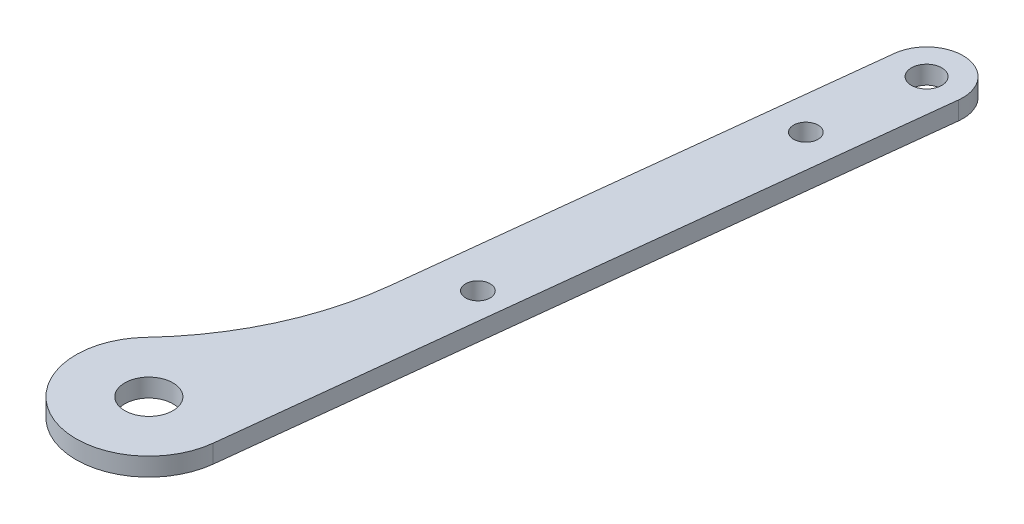
ISO-10303-21;
HEADER;
FILE_DESCRIPTION(('STEP AP214'),'2;1');
FILE_NAME('part.step','',(''),(''),'','','');
FILE_SCHEMA(('AUTOMOTIVE_DESIGN { 1 0 10303 214 1 1 1 1 }'));
ENDSEC;
DATA;
#1=APPLICATION_CONTEXT('core data for automotive mechanical design processes');
#2=APPLICATION_PROTOCOL_DEFINITION('international standard','automotive_design',2000,#1);
#3=PRODUCT_CONTEXT('',#1,'mechanical');
#4=PRODUCT('Part','Part','',(#3));
#5=PRODUCT_RELATED_PRODUCT_CATEGORY('part','',(#4));
#6=PRODUCT_DEFINITION_FORMATION('','',#4);
#7=PRODUCT_DEFINITION_CONTEXT('part definition',#1,'design');
#8=PRODUCT_DEFINITION('design','',#6,#7);
#9=PRODUCT_DEFINITION_SHAPE('','',#8);
#10=(LENGTH_UNIT() NAMED_UNIT(*) SI_UNIT(.MILLI.,.METRE.));
#11=(NAMED_UNIT(*) PLANE_ANGLE_UNIT() SI_UNIT($,.RADIAN.));
#12=(NAMED_UNIT(*) SI_UNIT($,.STERADIAN.) SOLID_ANGLE_UNIT());
#13=UNCERTAINTY_MEASURE_WITH_UNIT(LENGTH_MEASURE(1.E-05),#10,'distance_accuracy_value','');
#14=(GEOMETRIC_REPRESENTATION_CONTEXT(3) GLOBAL_UNCERTAINTY_ASSIGNED_CONTEXT((#13)) GLOBAL_UNIT_ASSIGNED_CONTEXT((#10,
#11,#12)) REPRESENTATION_CONTEXT('',''));
#15=CARTESIAN_POINT('',(0.,0.,0.));
#16=DIRECTION('',(0.,0.,1.));
#17=DIRECTION('',(1.,0.,0.));
#18=AXIS2_PLACEMENT_3D('',#15,#16,#17);
#19=CARTESIAN_POINT('',(6.56049999998811,-18.4375000000001,98.3869000000013));
#20=DIRECTION('',(0.,1.,0.));
#21=DIRECTION('',(0.,0.,1.));
#22=AXIS2_PLACEMENT_3D('',#19,#20,#21);
#23=PLANE('',#22);
#24=CARTESIAN_POINT('',(19.4709999999787,-18.4375000000001,37.1094));
#25=DIRECTION('',(0.,1.,0.));
#26=DIRECTION('',(0.,0.,1.));
#27=AXIS2_PLACEMENT_3D('',#24,#25,#26);
#28=CIRCLE('',#27,2.6543);
#29=CARTESIAN_POINT('',(19.4709999999787,-18.4375000000001,39.7637));
#30=VERTEX_POINT('',#29);
#31=EDGE_CURVE('E131',#30,#30,#28,.T.);
#32=ORIENTED_EDGE('',*,*,#31,.T.);
#33=EDGE_LOOP('',(#32));
#34=FACE_BOUND('',#33,.T.);
#35=CARTESIAN_POINT('',(0.,-18.4375000000001,153.3144));
#36=DIRECTION('',(0.,1.,0.));
#37=DIRECTION('',(0.,0.,1.));
#38=AXIS2_PLACEMENT_3D('',#35,#36,#37);
#39=CIRCLE('',#38,4.2037);
#40=CARTESIAN_POINT('',(0.,-18.4375000000001,157.5181));
#41=VERTEX_POINT('',#40);
#42=EDGE_CURVE('E134',#41,#41,#39,.T.);
#43=ORIENTED_EDGE('',*,*,#42,.T.);
#44=EDGE_LOOP('',(#43));
#45=FACE_BOUND('',#44,.T.);
#46=CARTESIAN_POINT('',(17.3400495907476,-18.4375000000001,56.0398397293865));
#47=DIRECTION('',(0.,-1.,0.));
#48=DIRECTION('',(0.,0.,-1.));
#49=AXIS2_PLACEMENT_3D('',#46,#47,#48);
#50=CIRCLE('',#49,2.1463);
#51=CARTESIAN_POINT('',(17.3400495907476,-18.4375000000001,53.8935397293865));
#52=VERTEX_POINT('',#51);
#53=EDGE_CURVE('E138',#52,#52,#50,.F.);
#54=ORIENTED_EDGE('',*,*,#53,.T.);
#55=EDGE_LOOP('',(#54));
#56=FACE_BOUND('',#55,.T.);
#57=CARTESIAN_POINT('',(12.7000000000016,-18.4375000000001,108.613413739759));
#58=DIRECTION('',(0.,-1.,0.));
#59=DIRECTION('',(0.,0.,-1.));
#60=AXIS2_PLACEMENT_3D('',#57,#58,#59);
#61=CIRCLE('',#60,2.1463);
#62=CARTESIAN_POINT('',(12.7000000000016,-18.4375000000001,106.467113739759));
#63=VERTEX_POINT('',#62);
#64=EDGE_CURVE('E142',#63,#63,#61,.F.);
#65=ORIENTED_EDGE('',*,*,#64,.T.);
#66=EDGE_LOOP('',(#65));
#67=FACE_BOUND('',#66,.T.);
#68=DIRECTION('',(0.111860914179471,0.,-0.99372387305475));
#69=VECTOR('',#68,1.);
#70=CARTESIAN_POINT('',(12.6202931877977,-18.4375000000001,154.735033610079));
#71=LINE('',#70,#69);
#72=CARTESIAN_POINT('',(12.6202931877977,-18.4375000000001,154.735033610079));
#73=VERTEX_POINT('',#72);
#74=CARTESIAN_POINT('',(25.7811465938763,-18.4375000000001,37.8197168050397));
#75=VERTEX_POINT('',#74);
#76=EDGE_CURVE('E69',#73,#75,#71,.T.);
#77=ORIENTED_EDGE('',*,*,#76,.F.);
#78=CARTESIAN_POINT('',(0.,-18.4375000000001,153.3144));
#79=DIRECTION('',(0.,1.,0.));
#80=DIRECTION('',(0.,0.,1.));
#81=AXIS2_PLACEMENT_3D('',#78,#79,#80);
#82=CIRCLE('',#81,12.7000000000024);
#83=CARTESIAN_POINT('',(-9.24385438419082,-18.4375000000001,144.605717199258));
#84=VERTEX_POINT('',#83);
#85=EDGE_CURVE('E147',#84,#73,#82,.T.);
#86=ORIENTED_EDGE('',*,*,#85,.F.);
#87=CARTESIAN_POINT('',(-46.219271920951,-18.4375000000001,109.770985996288));
#88=DIRECTION('',(0.,1.,0.));
#89=DIRECTION('',(0.,0.,1.));
#90=AXIS2_PLACEMENT_3D('',#87,#88,#89);
#91=CIRCLE('',#90,50.8000000000094);
#92=CARTESIAN_POINT('',(4.2619008302395,-18.4375000000001,115.453520436607));
#93=VERTEX_POINT('',#92);
#94=EDGE_CURVE('E87',#84,#93,#91,.T.);
#95=ORIENTED_EDGE('',*,*,#94,.T.);
#96=DIRECTION('',(-0.111860914179491,0.,0.993723873054748));
#97=VECTOR('',#96,1.);
#98=CARTESIAN_POINT('',(13.160853406081,-18.4375000000001,36.3990831949603));
#99=LINE('',#98,#97);
#100=CARTESIAN_POINT('',(13.1608534113733,-18.4375000000001,36.399083147946));
#101=VERTEX_POINT('',#100);
#102=EDGE_CURVE('E85',#101,#93,#99,.T.);
#103=ORIENTED_EDGE('',*,*,#102,.F.);
#104=CARTESIAN_POINT('',(19.4709999999787,-18.4375000000001,37.1094));
#105=DIRECTION('',(0.,1.,0.));
#106=DIRECTION('',(0.,0.,1.));
#107=AXIS2_PLACEMENT_3D('',#104,#105,#106);
#108=CIRCLE('',#107,6.35);
#109=EDGE_CURVE('E20',#75,#101,#108,.T.);
#110=ORIENTED_EDGE('',*,*,#109,.F.);
#111=EDGE_LOOP('',(#77,#86,#95,#103,#110));
#112=FACE_BOUND('',#111,.T.);
#113=ADVANCED_FACE('F17',(#34,#45,#56,#67,#112),#23,.F.);
#114=CARTESIAN_POINT('',(12.6202931877977,-18.4375000000001,154.735033610079));
#115=DIRECTION('',(0.99372387305475,0.,0.111860914179471));
#116=DIRECTION('',(0.111860914179471,0.,-0.99372387305475));
#117=AXIS2_PLACEMENT_3D('',#114,#115,#116);
#118=PLANE('',#117);
#119=ORIENTED_EDGE('',*,*,#76,.T.);
#120=DIRECTION('',(0.,1.,0.));
#121=VECTOR('',#120,1.);
#122=CARTESIAN_POINT('',(25.7811465938763,-18.4375000000001,37.8197168050397));
#123=LINE('',#122,#121);
#124=CARTESIAN_POINT('',(25.7811465938763,-15.2625,37.8197168050397));
#125=VERTEX_POINT('',#124);
#126=EDGE_CURVE('E81',#125,#75,#123,.F.);
#127=ORIENTED_EDGE('',*,*,#126,.F.);
#128=DIRECTION('',(0.11186091417947,0.,-0.99372387305475));
#129=VECTOR('',#128,1.);
#130=CARTESIAN_POINT('',(12.6202931877977,-15.2625,154.735033610079));
#131=LINE('',#130,#129);
#132=CARTESIAN_POINT('',(12.6202931877977,-15.2625,154.735033610079));
#133=VERTEX_POINT('',#132);
#134=EDGE_CURVE('E130',#133,#125,#131,.T.);
#135=ORIENTED_EDGE('',*,*,#134,.F.);
#136=DIRECTION('',(0.,1.,0.));
#137=VECTOR('',#136,1.);
#138=CARTESIAN_POINT('',(12.6202931877977,-18.4375000000001,154.735033610079));
#139=LINE('',#138,#137);
#140=EDGE_CURVE('E146',#73,#133,#139,.T.);
#141=ORIENTED_EDGE('',*,*,#140,.F.);
#142=EDGE_LOOP('',(#119,#127,#135,#141));
#143=FACE_BOUND('',#142,.T.);
#144=ADVANCED_FACE('F165',(#143),#118,.T.);
#145=CARTESIAN_POINT('',(19.4709999999787,-18.4375000000001,37.1094));
#146=DIRECTION('',(0.,1.,0.));
#147=DIRECTION('',(0.,0.,1.));
#148=AXIS2_PLACEMENT_3D('',#145,#146,#147);
#149=CYLINDRICAL_SURFACE('',#148,6.35);
#150=ORIENTED_EDGE('',*,*,#109,.T.);
#151=DIRECTION('',(0.,1.,0.));
#152=VECTOR('',#151,1.);
#153=CARTESIAN_POINT('',(13.1608534166656,-18.4375000000001,36.3990831009318));
#154=LINE('',#153,#152);
#155=CARTESIAN_POINT('',(13.1608534113733,-15.2625,36.399083147946));
#156=VERTEX_POINT('',#155);
#157=EDGE_CURVE('E79',#156,#101,#154,.F.);
#158=ORIENTED_EDGE('',*,*,#157,.F.);
#159=CARTESIAN_POINT('',(19.4709999999787,-15.2625,37.1094));
#160=DIRECTION('',(0.,1.,0.));
#161=DIRECTION('',(0.,0.,1.));
#162=AXIS2_PLACEMENT_3D('',#159,#160,#161);
#163=CIRCLE('',#162,6.35);
#164=EDGE_CURVE('E127',#125,#156,#163,.T.);
#165=ORIENTED_EDGE('',*,*,#164,.F.);
#166=ORIENTED_EDGE('',*,*,#126,.T.);
#167=EDGE_LOOP('',(#150,#158,#165,#166));
#168=FACE_BOUND('',#167,.T.);
#169=ADVANCED_FACE('F76',(#168),#149,.T.);
#170=CARTESIAN_POINT('',(13.160853406081,-18.4375000000001,36.3990831949603));
#171=DIRECTION('',(-0.993723873054748,0.,-0.111860914179491));
#172=DIRECTION('',(-0.111860914179491,0.,0.993723873054748));
#173=AXIS2_PLACEMENT_3D('',#170,#171,#172);
#174=PLANE('',#173);
#175=ORIENTED_EDGE('',*,*,#102,.T.);
#176=DIRECTION('',(0.,1.,0.));
#177=VECTOR('',#176,1.);
#178=CARTESIAN_POINT('',(4.26190083023954,-18.4375000000001,115.453520436607));
#179=LINE('',#178,#177);
#180=CARTESIAN_POINT('',(4.26190083023949,-15.2625,115.453520436607));
#181=VERTEX_POINT('',#180);
#182=EDGE_CURVE('E102',#93,#181,#179,.T.);
#183=ORIENTED_EDGE('',*,*,#182,.T.);
#184=DIRECTION('',(-0.111860914179491,0.,0.993723873054748));
#185=VECTOR('',#184,1.);
#186=CARTESIAN_POINT('',(13.1608534166655,-15.2625,36.3990831009318));
#187=LINE('',#186,#185);
#188=EDGE_CURVE('E94',#156,#181,#187,.T.);
#189=ORIENTED_EDGE('',*,*,#188,.F.);
#190=ORIENTED_EDGE('',*,*,#157,.T.);
#191=EDGE_LOOP('',(#175,#183,#189,#190));
#192=FACE_BOUND('',#191,.T.);
#193=ADVANCED_FACE('F92',(#192),#174,.T.);
#194=CARTESIAN_POINT('',(-46.219271920951,-18.4375000000001,109.770985996288));
#195=DIRECTION('',(0.,1.,0.));
#196=DIRECTION('',(0.,0.,1.));
#197=AXIS2_PLACEMENT_3D('',#194,#195,#196);
#198=CYLINDRICAL_SURFACE('',#197,50.8000000000094);
#199=ORIENTED_EDGE('',*,*,#182,.F.);
#200=ORIENTED_EDGE('',*,*,#94,.F.);
#201=DIRECTION('',(0.,1.,0.));
#202=VECTOR('',#201,1.);
#203=CARTESIAN_POINT('',(-9.24385438419141,-18.4375000000001,144.605717199259));
#204=LINE('',#203,#202);
#205=CARTESIAN_POINT('',(-9.24385438419082,-15.2625,144.605717199258));
#206=VERTEX_POINT('',#205);
#207=EDGE_CURVE('E40',#206,#84,#204,.F.);
#208=ORIENTED_EDGE('',*,*,#207,.F.);
#209=CARTESIAN_POINT('',(-46.219271920951,-15.2625,109.770985996288));
#210=DIRECTION('',(0.,1.,0.));
#211=DIRECTION('',(0.,0.,1.));
#212=AXIS2_PLACEMENT_3D('',#209,#210,#211);
#213=CIRCLE('',#212,50.8000000000094);
#214=EDGE_CURVE('E123',#181,#206,#213,.F.);
#215=ORIENTED_EDGE('',*,*,#214,.F.);
#216=EDGE_LOOP('',(#199,#200,#208,#215));
#217=FACE_BOUND('',#216,.T.);
#218=ADVANCED_FACE('F170',(#217),#198,.F.);
#219=CARTESIAN_POINT('',(0.,-18.4375000000001,153.3144));
#220=DIRECTION('',(0.,1.,0.));
#221=DIRECTION('',(0.,0.,1.));
#222=AXIS2_PLACEMENT_3D('',#219,#220,#221);
#223=CYLINDRICAL_SURFACE('',#222,12.7000000000024);
#224=ORIENTED_EDGE('',*,*,#85,.T.);
#225=ORIENTED_EDGE('',*,*,#140,.T.);
#226=CARTESIAN_POINT('',(0.,-15.2625,153.3144));
#227=DIRECTION('',(0.,1.,0.));
#228=DIRECTION('',(0.,0.,1.));
#229=AXIS2_PLACEMENT_3D('',#226,#227,#228);
#230=CIRCLE('',#229,12.7000000000024);
#231=EDGE_CURVE('E119',#206,#133,#230,.T.);
#232=ORIENTED_EDGE('',*,*,#231,.F.);
#233=ORIENTED_EDGE('',*,*,#207,.T.);
#234=EDGE_LOOP('',(#224,#225,#232,#233));
#235=FACE_BOUND('',#234,.T.);
#236=ADVANCED_FACE('F167',(#235),#223,.T.);
#237=CARTESIAN_POINT('',(12.7000000000016,-3.27250000000012,108.613413739759));
#238=DIRECTION('',(0.,-1.,0.));
#239=DIRECTION('',(0.,0.,-1.));
#240=AXIS2_PLACEMENT_3D('',#237,#238,#239);
#241=CYLINDRICAL_SURFACE('',#240,2.1463);
#242=ORIENTED_EDGE('',*,*,#64,.F.);
#243=EDGE_LOOP('',(#242));
#244=FACE_BOUND('',#243,.T.);
#245=CARTESIAN_POINT('',(12.7000000000016,-15.2625,108.613413739759));
#246=DIRECTION('',(0.,-1.,0.));
#247=DIRECTION('',(0.,0.,-1.));
#248=AXIS2_PLACEMENT_3D('',#245,#246,#247);
#249=CIRCLE('',#248,2.1463);
#250=CARTESIAN_POINT('',(12.7000000000016,-15.2625,106.467113739759));
#251=VERTEX_POINT('',#250);
#252=EDGE_CURVE('E115',#251,#251,#249,.T.);
#253=ORIENTED_EDGE('',*,*,#252,.F.);
#254=EDGE_LOOP('',(#253));
#255=FACE_BOUND('',#254,.T.);
#256=ADVANCED_FACE('F169',(#244,#255),#241,.F.);
#257=CARTESIAN_POINT('',(17.3400495907476,-3.27250000000012,56.0398397293865));
#258=DIRECTION('',(0.,-1.,0.));
#259=DIRECTION('',(0.,0.,-1.));
#260=AXIS2_PLACEMENT_3D('',#257,#258,#259);
#261=CYLINDRICAL_SURFACE('',#260,2.1463);
#262=ORIENTED_EDGE('',*,*,#53,.F.);
#263=EDGE_LOOP('',(#262));
#264=FACE_BOUND('',#263,.T.);
#265=CARTESIAN_POINT('',(17.3400495907476,-15.2625,56.0398397293865));
#266=DIRECTION('',(0.,-1.,0.));
#267=DIRECTION('',(0.,0.,-1.));
#268=AXIS2_PLACEMENT_3D('',#265,#266,#267);
#269=CIRCLE('',#268,2.1463);
#270=CARTESIAN_POINT('',(17.3400495907476,-15.2625,53.8935397293865));
#271=VERTEX_POINT('',#270);
#272=EDGE_CURVE('E111',#271,#271,#269,.T.);
#273=ORIENTED_EDGE('',*,*,#272,.F.);
#274=EDGE_LOOP('',(#273));
#275=FACE_BOUND('',#274,.T.);
#276=ADVANCED_FACE('F177',(#264,#275),#261,.F.);
#277=CARTESIAN_POINT('',(0.,-16.6912500000001,153.3144));
#278=DIRECTION('',(0.,1.,0.));
#279=DIRECTION('',(0.,0.,1.));
#280=AXIS2_PLACEMENT_3D('',#277,#278,#279);
#281=CYLINDRICAL_SURFACE('',#280,4.2037);
#282=CARTESIAN_POINT('',(0.,-15.2625,153.3144));
#283=DIRECTION('',(0.,1.,0.));
#284=DIRECTION('',(0.,0.,1.));
#285=AXIS2_PLACEMENT_3D('',#282,#283,#284);
#286=CIRCLE('',#285,4.2037);
#287=CARTESIAN_POINT('',(0.,-15.2625,157.5181));
#288=VERTEX_POINT('',#287);
#289=EDGE_CURVE('E27',#288,#288,#286,.F.);
#290=ORIENTED_EDGE('',*,*,#289,.F.);
#291=EDGE_LOOP('',(#290));
#292=FACE_BOUND('',#291,.T.);
#293=ORIENTED_EDGE('',*,*,#42,.F.);
#294=EDGE_LOOP('',(#293));
#295=FACE_BOUND('',#294,.T.);
#296=ADVANCED_FACE('F188',(#292,#295),#281,.F.);
#297=CARTESIAN_POINT('',(19.4709999999787,-16.6912500000001,37.1094));
#298=DIRECTION('',(0.,1.,0.));
#299=DIRECTION('',(0.,0.,1.));
#300=AXIS2_PLACEMENT_3D('',#297,#298,#299);
#301=CYLINDRICAL_SURFACE('',#300,2.6543);
#302=CARTESIAN_POINT('',(19.4709999999787,-15.2625,37.1094));
#303=DIRECTION('',(0.,1.,0.));
#304=DIRECTION('',(0.,0.,1.));
#305=AXIS2_PLACEMENT_3D('',#302,#303,#304);
#306=CIRCLE('',#305,2.6543);
#307=CARTESIAN_POINT('',(19.4709999999787,-15.2625,39.7637));
#308=VERTEX_POINT('',#307);
#309=EDGE_CURVE('E11',#308,#308,#306,.F.);
#310=ORIENTED_EDGE('',*,*,#309,.F.);
#311=EDGE_LOOP('',(#310));
#312=FACE_BOUND('',#311,.T.);
#313=ORIENTED_EDGE('',*,*,#31,.F.);
#314=EDGE_LOOP('',(#313));
#315=FACE_BOUND('',#314,.T.);
#316=ADVANCED_FACE('F182',(#312,#315),#301,.F.);
#317=CARTESIAN_POINT('',(6.56049999998811,-15.2625,98.3869000000013));
#318=DIRECTION('',(0.,1.,0.));
#319=DIRECTION('',(0.,0.,1.));
#320=AXIS2_PLACEMENT_3D('',#317,#318,#319);
#321=PLANE('',#320);
#322=ORIENTED_EDGE('',*,*,#309,.T.);
#323=EDGE_LOOP('',(#322));
#324=FACE_BOUND('',#323,.T.);
#325=ORIENTED_EDGE('',*,*,#289,.T.);
#326=EDGE_LOOP('',(#325));
#327=FACE_BOUND('',#326,.T.);
#328=ORIENTED_EDGE('',*,*,#272,.T.);
#329=EDGE_LOOP('',(#328));
#330=FACE_BOUND('',#329,.T.);
#331=ORIENTED_EDGE('',*,*,#252,.T.);
#332=EDGE_LOOP('',(#331));
#333=FACE_BOUND('',#332,.T.);
#334=ORIENTED_EDGE('',*,*,#214,.T.);
#335=ORIENTED_EDGE('',*,*,#231,.T.);
#336=ORIENTED_EDGE('',*,*,#134,.T.);
#337=ORIENTED_EDGE('',*,*,#164,.T.);
#338=ORIENTED_EDGE('',*,*,#188,.T.);
#339=EDGE_LOOP('',(#334,#335,#336,#337,#338));
#340=FACE_BOUND('',#339,.T.);
#341=ADVANCED_FACE('F163',(#324,#327,#330,#333,#340),#321,.T.);
#342=CLOSED_SHELL('',(#113,#144,#169,#193,#218,#236,#256,#276,#296,#316,#341));
#343=MANIFOLD_SOLID_BREP('B1',#342);
#344=ADVANCED_BREP_SHAPE_REPRESENTATION('',(#18,#343),#14);
#345=SHAPE_DEFINITION_REPRESENTATION(#9,#344);
ENDSEC;
END-ISO-10303-21;
